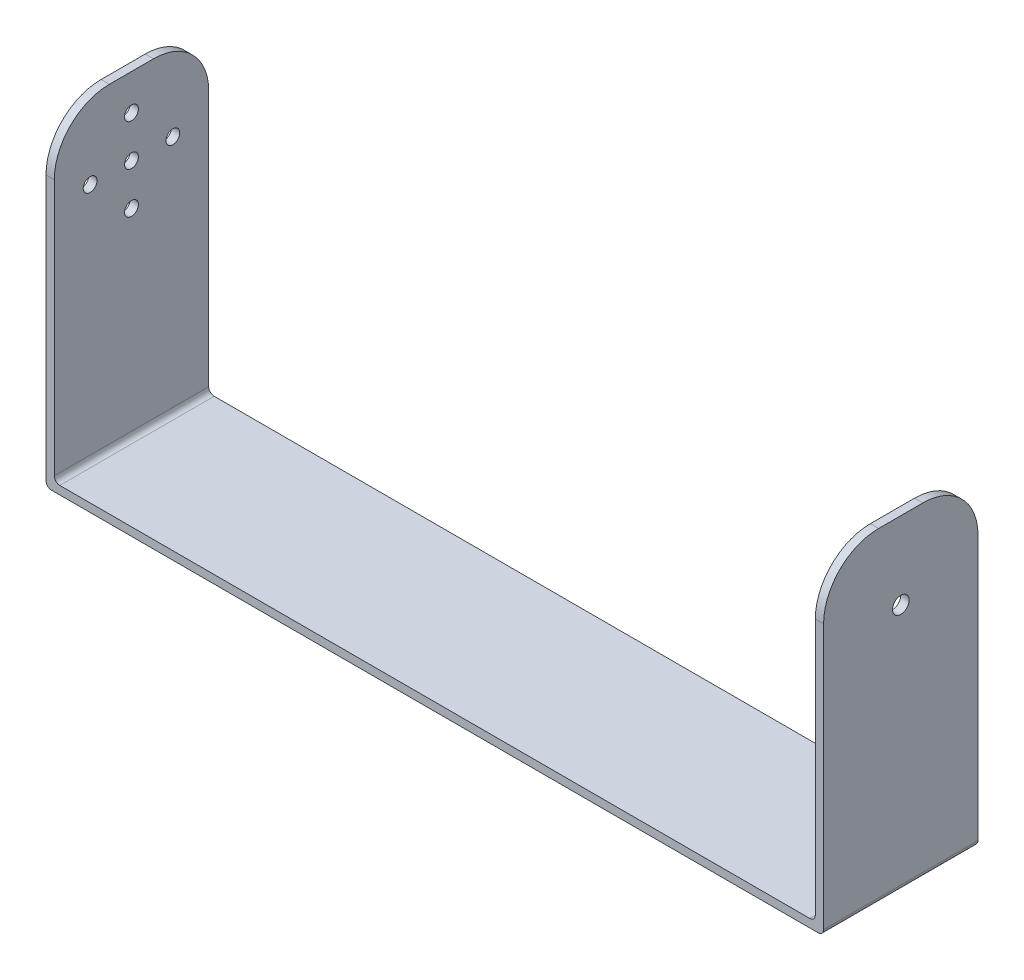
ISO-10303-21;
HEADER;
FILE_DESCRIPTION(('STEP AP214'),'2;1');
FILE_NAME('part.step','',(''),(''),'','','');
FILE_SCHEMA(('AUTOMOTIVE_DESIGN { 1 0 10303 214 1 1 1 1 }'));
ENDSEC;
DATA;
#1=APPLICATION_CONTEXT('core data for automotive mechanical design processes');
#2=APPLICATION_PROTOCOL_DEFINITION('international standard','automotive_design',2000,#1);
#3=PRODUCT_CONTEXT('',#1,'mechanical');
#4=PRODUCT('Part','Part','',(#3));
#5=PRODUCT_RELATED_PRODUCT_CATEGORY('part','',(#4));
#6=PRODUCT_DEFINITION_FORMATION('','',#4);
#7=PRODUCT_DEFINITION_CONTEXT('part definition',#1,'design');
#8=PRODUCT_DEFINITION('design','',#6,#7);
#9=PRODUCT_DEFINITION_SHAPE('','',#8);
#10=(LENGTH_UNIT() NAMED_UNIT(*) SI_UNIT(.MILLI.,.METRE.));
#11=(NAMED_UNIT(*) PLANE_ANGLE_UNIT() SI_UNIT($,.RADIAN.));
#12=(NAMED_UNIT(*) SI_UNIT($,.STERADIAN.) SOLID_ANGLE_UNIT());
#13=UNCERTAINTY_MEASURE_WITH_UNIT(LENGTH_MEASURE(1.E-05),#10,'distance_accuracy_value','');
#14=(GEOMETRIC_REPRESENTATION_CONTEXT(3) GLOBAL_UNCERTAINTY_ASSIGNED_CONTEXT((#13)) GLOBAL_UNIT_ASSIGNED_CONTEXT((#10,
#11,#12)) REPRESENTATION_CONTEXT('',''));
#15=CARTESIAN_POINT('',(0.,0.,0.));
#16=DIRECTION('',(0.,0.,1.));
#17=DIRECTION('',(1.,0.,0.));
#18=AXIS2_PLACEMENT_3D('',#15,#16,#17);
#19=CARTESIAN_POINT('',(139.5,0.,0.));
#20=DIRECTION('',(1.,0.,0.));
#21=DIRECTION('',(0.,0.,-1.));
#22=AXIS2_PLACEMENT_3D('',#19,#20,#21);
#23=PLANE('',#22);
#24=DIRECTION('',(0.,0.,1.));
#25=VECTOR('',#24,1.);
#26=CARTESIAN_POINT('',(139.5,59.,-28.));
#27=LINE('',#26,#25);
#28=CARTESIAN_POINT('',(139.5,59.,-18.));
#29=VERTEX_POINT('',#28);
#30=CARTESIAN_POINT('',(139.5,59.,-10.));
#31=VERTEX_POINT('',#30);
#32=EDGE_CURVE('E444',#29,#31,#27,.T.);
#33=ORIENTED_EDGE('',*,*,#32,.T.);
#34=CARTESIAN_POINT('',(139.5,49.,-10.));
#35=DIRECTION('',(1.,0.,0.));
#36=DIRECTION('',(0.,0.,-1.));
#37=AXIS2_PLACEMENT_3D('',#34,#35,#36);
#38=CIRCLE('',#37,10.);
#39=CARTESIAN_POINT('',(139.5,49.,0.));
#40=VERTEX_POINT('',#39);
#41=EDGE_CURVE('E11',#31,#40,#38,.T.);
#42=ORIENTED_EDGE('',*,*,#41,.T.);
#43=DIRECTION('',(0.,-1.,0.));
#44=VECTOR('',#43,1.);
#45=CARTESIAN_POINT('',(139.5,0.,0.));
#46=LINE('',#45,#44);
#47=CARTESIAN_POINT('',(139.5,1.,0.));
#48=VERTEX_POINT('',#47);
#49=EDGE_CURVE('E250',#40,#48,#46,.T.);
#50=ORIENTED_EDGE('',*,*,#49,.T.);
#51=DIRECTION('',(0.,0.,-1.));
#52=VECTOR('',#51,1.);
#53=CARTESIAN_POINT('',(139.5,1.,0.));
#54=LINE('',#53,#52);
#55=CARTESIAN_POINT('',(139.5,1.,-28.));
#56=VERTEX_POINT('',#55);
#57=EDGE_CURVE('E230',#48,#56,#54,.T.);
#58=ORIENTED_EDGE('',*,*,#57,.T.);
#59=DIRECTION('',(0.,1.,0.));
#60=VECTOR('',#59,1.);
#61=CARTESIAN_POINT('',(139.5,0.,-28.));
#62=LINE('',#61,#60);
#63=CARTESIAN_POINT('',(139.5,49.,-28.));
#64=VERTEX_POINT('',#63);
#65=EDGE_CURVE('E282',#56,#64,#62,.T.);
#66=ORIENTED_EDGE('',*,*,#65,.T.);
#67=CARTESIAN_POINT('',(139.5,49.,-18.));
#68=DIRECTION('',(1.,0.,0.));
#69=DIRECTION('',(0.,0.,-1.));
#70=AXIS2_PLACEMENT_3D('',#67,#68,#69);
#71=CIRCLE('',#70,10.);
#72=EDGE_CURVE('E283',#64,#29,#71,.T.);
#73=ORIENTED_EDGE('',*,*,#72,.T.);
#74=EDGE_LOOP('',(#33,#42,#50,#58,#66,#73));
#75=FACE_BOUND('',#74,.T.);
#76=CARTESIAN_POINT('',(139.5,45.,-14.));
#77=DIRECTION('',(1.,0.,0.));
#78=DIRECTION('',(0.,0.,-1.));
#79=AXIS2_PLACEMENT_3D('',#76,#77,#78);
#80=CIRCLE('',#79,1.5);
#81=CARTESIAN_POINT('',(139.5,45.,-15.5));
#82=VERTEX_POINT('',#81);
#83=EDGE_CURVE('E268',#82,#82,#80,.F.);
#84=ORIENTED_EDGE('',*,*,#83,.T.);
#85=EDGE_LOOP('',(#84));
#86=FACE_BOUND('',#85,.T.);
#87=ADVANCED_FACE('F33',(#75,#86),#23,.T.);
#88=CARTESIAN_POINT('',(138.,0.,0.));
#89=DIRECTION('',(1.,0.,0.));
#90=DIRECTION('',(0.,0.,-1.));
#91=AXIS2_PLACEMENT_3D('',#88,#89,#90);
#92=PLANE('',#91);
#93=DIRECTION('',(0.,-1.,0.));
#94=VECTOR('',#93,1.);
#95=CARTESIAN_POINT('',(138.,0.,0.));
#96=LINE('',#95,#94);
#97=CARTESIAN_POINT('',(138.,49.,0.));
#98=VERTEX_POINT('',#97);
#99=CARTESIAN_POINT('',(138.,2.5,0.));
#100=VERTEX_POINT('',#99);
#101=EDGE_CURVE('E275',#98,#100,#96,.T.);
#102=ORIENTED_EDGE('',*,*,#101,.F.);
#103=CARTESIAN_POINT('',(138.,49.,-10.));
#104=DIRECTION('',(1.,0.,0.));
#105=DIRECTION('',(0.,0.,-1.));
#106=AXIS2_PLACEMENT_3D('',#103,#104,#105);
#107=CIRCLE('',#106,10.);
#108=CARTESIAN_POINT('',(138.,59.,-10.));
#109=VERTEX_POINT('',#108);
#110=EDGE_CURVE('E55',#98,#109,#107,.F.);
#111=ORIENTED_EDGE('',*,*,#110,.T.);
#112=DIRECTION('',(0.,0.,1.));
#113=VECTOR('',#112,1.);
#114=CARTESIAN_POINT('',(138.,59.,-28.));
#115=LINE('',#114,#113);
#116=CARTESIAN_POINT('',(138.,59.,-18.));
#117=VERTEX_POINT('',#116);
#118=EDGE_CURVE('E267',#117,#109,#115,.T.);
#119=ORIENTED_EDGE('',*,*,#118,.F.);
#120=CARTESIAN_POINT('',(138.,49.,-18.));
#121=DIRECTION('',(1.,0.,0.));
#122=DIRECTION('',(0.,0.,-1.));
#123=AXIS2_PLACEMENT_3D('',#120,#121,#122);
#124=CIRCLE('',#123,10.);
#125=CARTESIAN_POINT('',(138.,49.,-28.));
#126=VERTEX_POINT('',#125);
#127=EDGE_CURVE('E293',#117,#126,#124,.F.);
#128=ORIENTED_EDGE('',*,*,#127,.T.);
#129=DIRECTION('',(0.,1.,0.));
#130=VECTOR('',#129,1.);
#131=CARTESIAN_POINT('',(138.,0.,-28.));
#132=LINE('',#131,#130);
#133=CARTESIAN_POINT('',(138.,2.5,-28.));
#134=VERTEX_POINT('',#133);
#135=EDGE_CURVE('E263',#134,#126,#132,.T.);
#136=ORIENTED_EDGE('',*,*,#135,.F.);
#137=DIRECTION('',(0.,0.,-1.));
#138=VECTOR('',#137,1.);
#139=CARTESIAN_POINT('',(138.,2.5,0.));
#140=LINE('',#139,#138);
#141=EDGE_CURVE('E262',#134,#100,#140,.F.);
#142=ORIENTED_EDGE('',*,*,#141,.T.);
#143=EDGE_LOOP('',(#102,#111,#119,#128,#136,#142));
#144=FACE_BOUND('',#143,.T.);
#145=CARTESIAN_POINT('',(138.,45.,-14.));
#146=DIRECTION('',(1.,0.,0.));
#147=DIRECTION('',(0.,0.,-1.));
#148=AXIS2_PLACEMENT_3D('',#145,#146,#147);
#149=CIRCLE('',#148,1.5);
#150=CARTESIAN_POINT('',(138.,45.,-15.5));
#151=VERTEX_POINT('',#150);
#152=EDGE_CURVE('E302',#151,#151,#149,.F.);
#153=ORIENTED_EDGE('',*,*,#152,.F.);
#154=EDGE_LOOP('',(#153));
#155=FACE_BOUND('',#154,.T.);
#156=ADVANCED_FACE('F309',(#144,#155),#92,.F.);
#157=CARTESIAN_POINT('',(-1.5,0.,0.));
#158=DIRECTION('',(-1.,0.,0.));
#159=DIRECTION('',(0.,0.,1.));
#160=AXIS2_PLACEMENT_3D('',#157,#158,#159);
#161=PLANE('',#160);
#162=CARTESIAN_POINT('',(-1.5,45.,-21.5));
#163=DIRECTION('',(-1.,0.,0.));
#164=DIRECTION('',(0.,0.,1.));
#165=AXIS2_PLACEMENT_3D('',#162,#163,#164);
#166=CIRCLE('',#165,1.25);
#167=CARTESIAN_POINT('',(-1.5,45.,-20.25));
#168=VERTEX_POINT('',#167);
#169=EDGE_CURVE('E242',#168,#168,#166,.F.);
#170=ORIENTED_EDGE('',*,*,#169,.T.);
#171=EDGE_LOOP('',(#170));
#172=FACE_BOUND('',#171,.T.);
#173=CARTESIAN_POINT('',(-1.5,45.,-6.50000000000001));
#174=DIRECTION('',(-1.,0.,0.));
#175=DIRECTION('',(0.,0.,1.));
#176=AXIS2_PLACEMENT_3D('',#173,#174,#175);
#177=CIRCLE('',#176,1.25);
#178=CARTESIAN_POINT('',(-1.5,45.,-5.25000000000001));
#179=VERTEX_POINT('',#178);
#180=EDGE_CURVE('E234',#179,#179,#177,.F.);
#181=ORIENTED_EDGE('',*,*,#180,.T.);
#182=EDGE_LOOP('',(#181));
#183=FACE_BOUND('',#182,.T.);
#184=DIRECTION('',(0.,-1.,0.));
#185=VECTOR('',#184,1.);
#186=CARTESIAN_POINT('',(-1.5,0.,0.));
#187=LINE('',#186,#185);
#188=CARTESIAN_POINT('',(-1.5,49.,0.));
#189=VERTEX_POINT('',#188);
#190=CARTESIAN_POINT('',(-1.5,1.,0.));
#191=VERTEX_POINT('',#190);
#192=EDGE_CURVE('E189',#189,#191,#187,.T.);
#193=ORIENTED_EDGE('',*,*,#192,.F.);
#194=CARTESIAN_POINT('',(-1.5,49.,-10.));
#195=DIRECTION('',(-1.,0.,0.));
#196=DIRECTION('',(0.,0.,1.));
#197=AXIS2_PLACEMENT_3D('',#194,#195,#196);
#198=CIRCLE('',#197,10.);
#199=CARTESIAN_POINT('',(-1.5,59.,-10.));
#200=VERTEX_POINT('',#199);
#201=EDGE_CURVE('E225',#189,#200,#198,.T.);
#202=ORIENTED_EDGE('',*,*,#201,.T.);
#203=DIRECTION('',(0.,0.,1.));
#204=VECTOR('',#203,1.);
#205=CARTESIAN_POINT('',(-1.5,59.,0.));
#206=LINE('',#205,#204);
#207=CARTESIAN_POINT('',(-1.5,59.,-18.));
#208=VERTEX_POINT('',#207);
#209=EDGE_CURVE('E185',#208,#200,#206,.T.);
#210=ORIENTED_EDGE('',*,*,#209,.F.);
#211=CARTESIAN_POINT('',(-1.5,49.,-18.));
#212=DIRECTION('',(-1.,0.,0.));
#213=DIRECTION('',(0.,0.,1.));
#214=AXIS2_PLACEMENT_3D('',#211,#212,#213);
#215=CIRCLE('',#214,10.);
#216=CARTESIAN_POINT('',(-1.5,49.,-28.));
#217=VERTEX_POINT('',#216);
#218=EDGE_CURVE('E223',#208,#217,#215,.T.);
#219=ORIENTED_EDGE('',*,*,#218,.T.);
#220=DIRECTION('',(0.,1.,0.));
#221=VECTOR('',#220,1.);
#222=CARTESIAN_POINT('',(-1.5,0.,-28.));
#223=LINE('',#222,#221);
#224=CARTESIAN_POINT('',(-1.5,1.,-28.));
#225=VERTEX_POINT('',#224);
#226=EDGE_CURVE('E336',#225,#217,#223,.T.);
#227=ORIENTED_EDGE('',*,*,#226,.F.);
#228=DIRECTION('',(0.,0.,-1.));
#229=VECTOR('',#228,1.);
#230=CARTESIAN_POINT('',(-1.5,1.,0.));
#231=LINE('',#230,#229);
#232=EDGE_CURVE('E205',#225,#191,#231,.F.);
#233=ORIENTED_EDGE('',*,*,#232,.T.);
#234=EDGE_LOOP('',(#193,#202,#210,#219,#227,#233));
#235=FACE_BOUND('',#234,.T.);
#236=CARTESIAN_POINT('',(-1.5,52.5,-14.));
#237=DIRECTION('',(-1.,0.,0.));
#238=DIRECTION('',(0.,0.,1.));
#239=AXIS2_PLACEMENT_3D('',#236,#237,#238);
#240=CIRCLE('',#239,1.25);
#241=CARTESIAN_POINT('',(-1.5,52.5,-12.75));
#242=VERTEX_POINT('',#241);
#243=EDGE_CURVE('E217',#242,#242,#240,.F.);
#244=ORIENTED_EDGE('',*,*,#243,.T.);
#245=EDGE_LOOP('',(#244));
#246=FACE_BOUND('',#245,.T.);
#247=CARTESIAN_POINT('',(-1.5,45.,-14.));
#248=DIRECTION('',(-1.,0.,0.));
#249=DIRECTION('',(0.,0.,1.));
#250=AXIS2_PLACEMENT_3D('',#247,#248,#249);
#251=CIRCLE('',#250,1.25);
#252=CARTESIAN_POINT('',(-1.5,45.,-12.75));
#253=VERTEX_POINT('',#252);
#254=EDGE_CURVE('E238',#253,#253,#251,.F.);
#255=ORIENTED_EDGE('',*,*,#254,.T.);
#256=EDGE_LOOP('',(#255));
#257=FACE_BOUND('',#256,.T.);
#258=CARTESIAN_POINT('',(-1.5,37.5,-14.));
#259=DIRECTION('',(-1.,0.,0.));
#260=DIRECTION('',(0.,0.,1.));
#261=AXIS2_PLACEMENT_3D('',#258,#259,#260);
#262=CIRCLE('',#261,1.25);
#263=CARTESIAN_POINT('',(-1.5,37.5,-12.75));
#264=VERTEX_POINT('',#263);
#265=EDGE_CURVE('E246',#264,#264,#262,.F.);
#266=ORIENTED_EDGE('',*,*,#265,.T.);
#267=EDGE_LOOP('',(#266));
#268=FACE_BOUND('',#267,.T.);
#269=ADVANCED_FACE('F330',(#172,#183,#235,#246,#257,#268),#161,.T.);
#270=CARTESIAN_POINT('',(0.,0.,0.));
#271=DIRECTION('',(-1.,0.,0.));
#272=DIRECTION('',(0.,0.,1.));
#273=AXIS2_PLACEMENT_3D('',#270,#271,#272);
#274=PLANE('',#273);
#275=CARTESIAN_POINT('',(0.,45.,-21.5));
#276=DIRECTION('',(-1.,0.,0.));
#277=DIRECTION('',(0.,0.,1.));
#278=AXIS2_PLACEMENT_3D('',#275,#276,#277);
#279=CIRCLE('',#278,1.25);
#280=CARTESIAN_POINT('',(0.,45.,-20.25));
#281=VERTEX_POINT('',#280);
#282=EDGE_CURVE('E243',#281,#281,#279,.F.);
#283=ORIENTED_EDGE('',*,*,#282,.F.);
#284=EDGE_LOOP('',(#283));
#285=FACE_BOUND('',#284,.T.);
#286=CARTESIAN_POINT('',(0.,45.,-6.50000000000001));
#287=DIRECTION('',(-1.,0.,0.));
#288=DIRECTION('',(0.,0.,1.));
#289=AXIS2_PLACEMENT_3D('',#286,#287,#288);
#290=CIRCLE('',#289,1.25);
#291=CARTESIAN_POINT('',(0.,45.,-5.25000000000001));
#292=VERTEX_POINT('',#291);
#293=EDGE_CURVE('E235',#292,#292,#290,.F.);
#294=ORIENTED_EDGE('',*,*,#293,.F.);
#295=EDGE_LOOP('',(#294));
#296=FACE_BOUND('',#295,.T.);
#297=DIRECTION('',(0.,0.,1.));
#298=VECTOR('',#297,1.);
#299=CARTESIAN_POINT('',(0.,59.,0.));
#300=LINE('',#299,#298);
#301=CARTESIAN_POINT('',(0.,59.,-18.));
#302=VERTEX_POINT('',#301);
#303=CARTESIAN_POINT('',(0.,59.,-10.));
#304=VERTEX_POINT('',#303);
#305=EDGE_CURVE('E186',#302,#304,#300,.T.);
#306=ORIENTED_EDGE('',*,*,#305,.T.);
#307=CARTESIAN_POINT('',(0.,49.,-10.));
#308=DIRECTION('',(-1.,0.,0.));
#309=DIRECTION('',(0.,0.,1.));
#310=AXIS2_PLACEMENT_3D('',#307,#308,#309);
#311=CIRCLE('',#310,10.);
#312=CARTESIAN_POINT('',(0.,49.,0.));
#313=VERTEX_POINT('',#312);
#314=EDGE_CURVE('E219',#304,#313,#311,.F.);
#315=ORIENTED_EDGE('',*,*,#314,.T.);
#316=DIRECTION('',(0.,-1.,0.));
#317=VECTOR('',#316,1.);
#318=CARTESIAN_POINT('',(0.,0.,0.));
#319=LINE('',#318,#317);
#320=CARTESIAN_POINT('',(0.,2.5,0.));
#321=VERTEX_POINT('',#320);
#322=EDGE_CURVE('E197',#313,#321,#319,.T.);
#323=ORIENTED_EDGE('',*,*,#322,.T.);
#324=DIRECTION('',(0.,0.,1.));
#325=VECTOR('',#324,1.);
#326=CARTESIAN_POINT('',(0.,2.5,-28.));
#327=LINE('',#326,#325);
#328=CARTESIAN_POINT('',(0.,2.5,-28.));
#329=VERTEX_POINT('',#328);
#330=EDGE_CURVE('E152',#321,#329,#327,.F.);
#331=ORIENTED_EDGE('',*,*,#330,.T.);
#332=DIRECTION('',(0.,1.,0.));
#333=VECTOR('',#332,1.);
#334=CARTESIAN_POINT('',(0.,0.,-28.));
#335=LINE('',#334,#333);
#336=CARTESIAN_POINT('',(0.,49.,-28.));
#337=VERTEX_POINT('',#336);
#338=EDGE_CURVE('E190',#329,#337,#335,.T.);
#339=ORIENTED_EDGE('',*,*,#338,.T.);
#340=CARTESIAN_POINT('',(0.,49.,-18.));
#341=DIRECTION('',(-1.,0.,0.));
#342=DIRECTION('',(0.,0.,1.));
#343=AXIS2_PLACEMENT_3D('',#340,#341,#342);
#344=CIRCLE('',#343,10.);
#345=EDGE_CURVE('E215',#337,#302,#344,.F.);
#346=ORIENTED_EDGE('',*,*,#345,.T.);
#347=EDGE_LOOP('',(#306,#315,#323,#331,#339,#346));
#348=FACE_BOUND('',#347,.T.);
#349=CARTESIAN_POINT('',(0.,52.5,-14.));
#350=DIRECTION('',(-1.,0.,0.));
#351=DIRECTION('',(0.,0.,1.));
#352=AXIS2_PLACEMENT_3D('',#349,#350,#351);
#353=CIRCLE('',#352,1.25);
#354=CARTESIAN_POINT('',(0.,52.5,-12.75));
#355=VERTEX_POINT('',#354);
#356=EDGE_CURVE('E231',#355,#355,#353,.F.);
#357=ORIENTED_EDGE('',*,*,#356,.F.);
#358=EDGE_LOOP('',(#357));
#359=FACE_BOUND('',#358,.T.);
#360=CARTESIAN_POINT('',(0.,45.,-14.));
#361=DIRECTION('',(-1.,0.,0.));
#362=DIRECTION('',(0.,0.,1.));
#363=AXIS2_PLACEMENT_3D('',#360,#361,#362);
#364=CIRCLE('',#363,1.25);
#365=CARTESIAN_POINT('',(0.,45.,-12.75));
#366=VERTEX_POINT('',#365);
#367=EDGE_CURVE('E239',#366,#366,#364,.F.);
#368=ORIENTED_EDGE('',*,*,#367,.F.);
#369=EDGE_LOOP('',(#368));
#370=FACE_BOUND('',#369,.T.);
#371=CARTESIAN_POINT('',(0.,37.5,-14.));
#372=DIRECTION('',(-1.,0.,0.));
#373=DIRECTION('',(0.,0.,1.));
#374=AXIS2_PLACEMENT_3D('',#371,#372,#373);
#375=CIRCLE('',#374,1.25);
#376=CARTESIAN_POINT('',(0.,37.5,-12.75));
#377=VERTEX_POINT('',#376);
#378=EDGE_CURVE('E247',#377,#377,#375,.F.);
#379=ORIENTED_EDGE('',*,*,#378,.F.);
#380=EDGE_LOOP('',(#379));
#381=FACE_BOUND('',#380,.T.);
#382=ADVANCED_FACE('F318',(#285,#296,#348,#359,#370,#381),#274,.F.);
#383=CARTESIAN_POINT('',(0.,1.5,0.));
#384=DIRECTION('',(0.,0.,-1.));
#385=DIRECTION('',(-1.,0.,0.));
#386=AXIS2_PLACEMENT_3D('',#383,#384,#385);
#387=PLANE('',#386);
#388=ORIENTED_EDGE('',*,*,#49,.F.);
#389=DIRECTION('',(-1.,0.,0.));
#390=VECTOR('',#389,1.);
#391=CARTESIAN_POINT('',(0.,49.,0.));
#392=LINE('',#391,#390);
#393=EDGE_CURVE('E285',#40,#98,#392,.T.);
#394=ORIENTED_EDGE('',*,*,#393,.T.);
#395=ORIENTED_EDGE('',*,*,#101,.T.);
#396=CARTESIAN_POINT('',(137.,2.5,0.));
#397=DIRECTION('',(0.,0.,-1.));
#398=DIRECTION('',(-1.,0.,0.));
#399=AXIS2_PLACEMENT_3D('',#396,#397,#398);
#400=CIRCLE('',#399,1.);
#401=CARTESIAN_POINT('',(137.,1.5,0.));
#402=VERTEX_POINT('',#401);
#403=EDGE_CURVE('E171',#100,#402,#400,.T.);
#404=ORIENTED_EDGE('',*,*,#403,.T.);
#405=DIRECTION('',(1.,0.,0.));
#406=VECTOR('',#405,1.);
#407=CARTESIAN_POINT('',(0.,1.5,0.));
#408=LINE('',#407,#406);
#409=CARTESIAN_POINT('',(1.,1.5,0.));
#410=VERTEX_POINT('',#409);
#411=EDGE_CURVE('E162',#410,#402,#408,.T.);
#412=ORIENTED_EDGE('',*,*,#411,.F.);
#413=CARTESIAN_POINT('',(1.,2.5,0.));
#414=DIRECTION('',(0.,0.,-1.));
#415=DIRECTION('',(-1.,0.,0.));
#416=AXIS2_PLACEMENT_3D('',#413,#414,#415);
#417=CIRCLE('',#416,1.);
#418=EDGE_CURVE('E147',#410,#321,#417,.T.);
#419=ORIENTED_EDGE('',*,*,#418,.T.);
#420=ORIENTED_EDGE('',*,*,#322,.F.);
#421=DIRECTION('',(1.,0.,0.));
#422=VECTOR('',#421,1.);
#423=CARTESIAN_POINT('',(-1.5,49.,0.));
#424=LINE('',#423,#422);
#425=EDGE_CURVE('E221',#313,#189,#424,.F.);
#426=ORIENTED_EDGE('',*,*,#425,.T.);
#427=ORIENTED_EDGE('',*,*,#192,.T.);
#428=CARTESIAN_POINT('',(-0.5,1.,0.));
#429=DIRECTION('',(0.,0.,-1.));
#430=DIRECTION('',(-1.,0.,0.));
#431=AXIS2_PLACEMENT_3D('',#428,#429,#430);
#432=CIRCLE('',#431,1.);
#433=CARTESIAN_POINT('',(-0.5,0.,0.));
#434=VERTEX_POINT('',#433);
#435=EDGE_CURVE('E208',#191,#434,#432,.F.);
#436=ORIENTED_EDGE('',*,*,#435,.T.);
#437=DIRECTION('',(1.,0.,0.));
#438=VECTOR('',#437,1.);
#439=CARTESIAN_POINT('',(0.,0.,0.));
#440=LINE('',#439,#438);
#441=CARTESIAN_POINT('',(138.5,0.,0.));
#442=VERTEX_POINT('',#441);
#443=EDGE_CURVE('E175',#434,#442,#440,.T.);
#444=ORIENTED_EDGE('',*,*,#443,.T.);
#445=CARTESIAN_POINT('',(138.5,1.,0.));
#446=DIRECTION('',(0.,0.,-1.));
#447=DIRECTION('',(-1.,0.,0.));
#448=AXIS2_PLACEMENT_3D('',#445,#446,#447);
#449=CIRCLE('',#448,1.);
#450=EDGE_CURVE('E257',#442,#48,#449,.F.);
#451=ORIENTED_EDGE('',*,*,#450,.T.);
#452=EDGE_LOOP('',(#388,#394,#395,#404,#412,#419,#420,#426,#427,#436,#444,#451));
#453=FACE_BOUND('',#452,.T.);
#454=ADVANCED_FACE('F169',(#453),#387,.F.);
#455=CARTESIAN_POINT('',(0.,1.5,-28.));
#456=DIRECTION('',(0.,0.,1.));
#457=DIRECTION('',(1.,0.,0.));
#458=AXIS2_PLACEMENT_3D('',#455,#456,#457);
#459=PLANE('',#458);
#460=ORIENTED_EDGE('',*,*,#135,.T.);
#461=DIRECTION('',(-1.,0.,0.));
#462=VECTOR('',#461,1.);
#463=CARTESIAN_POINT('',(0.,49.,-28.));
#464=LINE('',#463,#462);
#465=EDGE_CURVE('E289',#126,#64,#464,.F.);
#466=ORIENTED_EDGE('',*,*,#465,.T.);
#467=ORIENTED_EDGE('',*,*,#65,.F.);
#468=CARTESIAN_POINT('',(138.5,1.,-28.));
#469=DIRECTION('',(0.,0.,1.));
#470=DIRECTION('',(1.,0.,0.));
#471=AXIS2_PLACEMENT_3D('',#468,#469,#470);
#472=CIRCLE('',#471,1.);
#473=CARTESIAN_POINT('',(138.5,0.,-28.));
#474=VERTEX_POINT('',#473);
#475=EDGE_CURVE('E253',#56,#474,#472,.F.);
#476=ORIENTED_EDGE('',*,*,#475,.T.);
#477=DIRECTION('',(-1.,0.,0.));
#478=VECTOR('',#477,1.);
#479=CARTESIAN_POINT('',(0.,0.,-28.));
#480=LINE('',#479,#478);
#481=CARTESIAN_POINT('',(-0.5,0.,-28.));
#482=VERTEX_POINT('',#481);
#483=EDGE_CURVE('E172',#474,#482,#480,.T.);
#484=ORIENTED_EDGE('',*,*,#483,.T.);
#485=CARTESIAN_POINT('',(-0.5,1.,-28.));
#486=DIRECTION('',(0.,0.,1.));
#487=DIRECTION('',(1.,0.,0.));
#488=AXIS2_PLACEMENT_3D('',#485,#486,#487);
#489=CIRCLE('',#488,1.);
#490=EDGE_CURVE('E203',#482,#225,#489,.F.);
#491=ORIENTED_EDGE('',*,*,#490,.T.);
#492=ORIENTED_EDGE('',*,*,#226,.T.);
#493=DIRECTION('',(1.,0.,0.));
#494=VECTOR('',#493,1.);
#495=CARTESIAN_POINT('',(0.,49.,-28.));
#496=LINE('',#495,#494);
#497=EDGE_CURVE('E227',#217,#337,#496,.T.);
#498=ORIENTED_EDGE('',*,*,#497,.T.);
#499=ORIENTED_EDGE('',*,*,#338,.F.);
#500=CARTESIAN_POINT('',(1.,2.5,-28.));
#501=DIRECTION('',(0.,0.,1.));
#502=DIRECTION('',(1.,0.,0.));
#503=AXIS2_PLACEMENT_3D('',#500,#501,#502);
#504=CIRCLE('',#503,1.);
#505=CARTESIAN_POINT('',(1.,1.5,-28.));
#506=VERTEX_POINT('',#505);
#507=EDGE_CURVE('E156',#329,#506,#504,.T.);
#508=ORIENTED_EDGE('',*,*,#507,.T.);
#509=DIRECTION('',(-1.,0.,0.));
#510=VECTOR('',#509,1.);
#511=CARTESIAN_POINT('',(0.,1.5,-28.));
#512=LINE('',#511,#510);
#513=CARTESIAN_POINT('',(137.,1.5,-28.));
#514=VERTEX_POINT('',#513);
#515=EDGE_CURVE('E165',#514,#506,#512,.T.);
#516=ORIENTED_EDGE('',*,*,#515,.F.);
#517=CARTESIAN_POINT('',(137.,2.5,-28.));
#518=DIRECTION('',(0.,0.,1.));
#519=DIRECTION('',(1.,0.,0.));
#520=AXIS2_PLACEMENT_3D('',#517,#518,#519);
#521=CIRCLE('',#520,1.);
#522=EDGE_CURVE('E305',#514,#134,#521,.T.);
#523=ORIENTED_EDGE('',*,*,#522,.T.);
#524=EDGE_LOOP('',(#460,#466,#467,#476,#484,#491,#492,#498,#499,#508,#516,#523));
#525=FACE_BOUND('',#524,.T.);
#526=ADVANCED_FACE('F313',(#525),#459,.F.);
#527=CARTESIAN_POINT('',(0.,1.5,0.));
#528=DIRECTION('',(0.,-1.,0.));
#529=DIRECTION('',(0.,0.,-1.));
#530=AXIS2_PLACEMENT_3D('',#527,#528,#529);
#531=PLANE('',#530);
#532=ORIENTED_EDGE('',*,*,#411,.T.);
#533=DIRECTION('',(0.,0.,-1.));
#534=VECTOR('',#533,1.);
#535=CARTESIAN_POINT('',(137.,1.5,-28.));
#536=LINE('',#535,#534);
#537=EDGE_CURVE('E259',#402,#514,#536,.T.);
#538=ORIENTED_EDGE('',*,*,#537,.T.);
#539=ORIENTED_EDGE('',*,*,#515,.T.);
#540=DIRECTION('',(0.,0.,1.));
#541=VECTOR('',#540,1.);
#542=CARTESIAN_POINT('',(1.,1.5,0.));
#543=LINE('',#542,#541);
#544=EDGE_CURVE('E151',#506,#410,#543,.T.);
#545=ORIENTED_EDGE('',*,*,#544,.T.);
#546=EDGE_LOOP('',(#532,#538,#539,#545));
#547=FACE_BOUND('',#546,.T.);
#548=ADVANCED_FACE('F160',(#547),#531,.F.);
#549=CARTESIAN_POINT('',(0.,0.,0.));
#550=DIRECTION('',(0.,-1.,0.));
#551=DIRECTION('',(0.,0.,-1.));
#552=AXIS2_PLACEMENT_3D('',#549,#550,#551);
#553=PLANE('',#552);
#554=ORIENTED_EDGE('',*,*,#483,.F.);
#555=DIRECTION('',(0.,0.,-1.));
#556=VECTOR('',#555,1.);
#557=CARTESIAN_POINT('',(138.5,0.,0.));
#558=LINE('',#557,#556);
#559=EDGE_CURVE('E255',#474,#442,#558,.F.);
#560=ORIENTED_EDGE('',*,*,#559,.T.);
#561=ORIENTED_EDGE('',*,*,#443,.F.);
#562=DIRECTION('',(0.,0.,-1.));
#563=VECTOR('',#562,1.);
#564=CARTESIAN_POINT('',(-0.5,0.,0.));
#565=LINE('',#564,#563);
#566=EDGE_CURVE('E200',#434,#482,#565,.T.);
#567=ORIENTED_EDGE('',*,*,#566,.T.);
#568=EDGE_LOOP('',(#554,#560,#561,#567));
#569=FACE_BOUND('',#568,.T.);
#570=ADVANCED_FACE('F409',(#569),#553,.T.);
#571=CARTESIAN_POINT('',(-1.5,59.,0.));
#572=DIRECTION('',(0.,1.,0.));
#573=DIRECTION('',(0.,0.,1.));
#574=AXIS2_PLACEMENT_3D('',#571,#572,#573);
#575=PLANE('',#574);
#576=ORIENTED_EDGE('',*,*,#209,.T.);
#577=DIRECTION('',(1.,0.,0.));
#578=VECTOR('',#577,1.);
#579=CARTESIAN_POINT('',(0.,59.,-10.));
#580=LINE('',#579,#578);
#581=EDGE_CURVE('E212',#200,#304,#580,.T.);
#582=ORIENTED_EDGE('',*,*,#581,.T.);
#583=ORIENTED_EDGE('',*,*,#305,.F.);
#584=DIRECTION('',(1.,0.,0.));
#585=VECTOR('',#584,1.);
#586=CARTESIAN_POINT('',(-1.5,59.,-18.));
#587=LINE('',#586,#585);
#588=EDGE_CURVE('E210',#302,#208,#587,.F.);
#589=ORIENTED_EDGE('',*,*,#588,.T.);
#590=EDGE_LOOP('',(#576,#582,#583,#589));
#591=FACE_BOUND('',#590,.T.);
#592=ADVANCED_FACE('F334',(#591),#575,.T.);
#593=CARTESIAN_POINT('',(1.,2.5,0.));
#594=DIRECTION('',(0.,0.,-1.));
#595=DIRECTION('',(-1.,0.,0.));
#596=AXIS2_PLACEMENT_3D('',#593,#594,#595);
#597=CYLINDRICAL_SURFACE('',#596,1.);
#598=ORIENTED_EDGE('',*,*,#507,.F.);
#599=ORIENTED_EDGE('',*,*,#330,.F.);
#600=ORIENTED_EDGE('',*,*,#418,.F.);
#601=ORIENTED_EDGE('',*,*,#544,.F.);
#602=EDGE_LOOP('',(#598,#599,#600,#601));
#603=FACE_BOUND('',#602,.T.);
#604=ADVANCED_FACE('F150',(#603),#597,.F.);
#605=CARTESIAN_POINT('',(-0.5,1.,0.));
#606=DIRECTION('',(0.,0.,-1.));
#607=DIRECTION('',(-1.,0.,0.));
#608=AXIS2_PLACEMENT_3D('',#605,#606,#607);
#609=CYLINDRICAL_SURFACE('',#608,1.);
#610=ORIENTED_EDGE('',*,*,#435,.F.);
#611=ORIENTED_EDGE('',*,*,#232,.F.);
#612=ORIENTED_EDGE('',*,*,#490,.F.);
#613=ORIENTED_EDGE('',*,*,#566,.F.);
#614=EDGE_LOOP('',(#610,#611,#612,#613));
#615=FACE_BOUND('',#614,.T.);
#616=ADVANCED_FACE('F421',(#615),#609,.T.);
#617=CARTESIAN_POINT('',(-1.5,49.,-10.));
#618=DIRECTION('',(-1.,0.,0.));
#619=DIRECTION('',(0.,0.,1.));
#620=AXIS2_PLACEMENT_3D('',#617,#618,#619);
#621=CYLINDRICAL_SURFACE('',#620,10.);
#622=ORIENTED_EDGE('',*,*,#201,.F.);
#623=ORIENTED_EDGE('',*,*,#425,.F.);
#624=ORIENTED_EDGE('',*,*,#314,.F.);
#625=ORIENTED_EDGE('',*,*,#581,.F.);
#626=EDGE_LOOP('',(#622,#623,#624,#625));
#627=FACE_BOUND('',#626,.T.);
#628=ADVANCED_FACE('F325',(#627),#621,.T.);
#629=CARTESIAN_POINT('',(0.,49.,-18.));
#630=DIRECTION('',(-1.,0.,0.));
#631=DIRECTION('',(0.,0.,1.));
#632=AXIS2_PLACEMENT_3D('',#629,#630,#631);
#633=CYLINDRICAL_SURFACE('',#632,10.);
#634=ORIENTED_EDGE('',*,*,#218,.F.);
#635=ORIENTED_EDGE('',*,*,#588,.F.);
#636=ORIENTED_EDGE('',*,*,#345,.F.);
#637=ORIENTED_EDGE('',*,*,#497,.F.);
#638=EDGE_LOOP('',(#634,#635,#636,#637));
#639=FACE_BOUND('',#638,.T.);
#640=ADVANCED_FACE('F374',(#639),#633,.T.);
#641=CARTESIAN_POINT('',(15.,52.5,-14.));
#642=DIRECTION('',(-1.,0.,0.));
#643=DIRECTION('',(0.,0.,1.));
#644=AXIS2_PLACEMENT_3D('',#641,#642,#643);
#645=CYLINDRICAL_SURFACE('',#644,1.25);
#646=ORIENTED_EDGE('',*,*,#243,.F.);
#647=EDGE_LOOP('',(#646));
#648=FACE_BOUND('',#647,.T.);
#649=ORIENTED_EDGE('',*,*,#356,.T.);
#650=EDGE_LOOP('',(#649));
#651=FACE_BOUND('',#650,.T.);
#652=ADVANCED_FACE('F365',(#648,#651),#645,.F.);
#653=CARTESIAN_POINT('',(15.,45.,-6.50000000000001));
#654=DIRECTION('',(-1.,0.,0.));
#655=DIRECTION('',(0.,0.,1.));
#656=AXIS2_PLACEMENT_3D('',#653,#654,#655);
#657=CYLINDRICAL_SURFACE('',#656,1.25);
#658=ORIENTED_EDGE('',*,*,#180,.F.);
#659=EDGE_LOOP('',(#658));
#660=FACE_BOUND('',#659,.T.);
#661=ORIENTED_EDGE('',*,*,#293,.T.);
#662=EDGE_LOOP('',(#661));
#663=FACE_BOUND('',#662,.T.);
#664=ADVANCED_FACE('F363',(#660,#663),#657,.F.);
#665=CARTESIAN_POINT('',(15.,45.,-14.));
#666=DIRECTION('',(-1.,0.,0.));
#667=DIRECTION('',(0.,0.,1.));
#668=AXIS2_PLACEMENT_3D('',#665,#666,#667);
#669=CYLINDRICAL_SURFACE('',#668,1.25);
#670=ORIENTED_EDGE('',*,*,#254,.F.);
#671=EDGE_LOOP('',(#670));
#672=FACE_BOUND('',#671,.T.);
#673=ORIENTED_EDGE('',*,*,#367,.T.);
#674=EDGE_LOOP('',(#673));
#675=FACE_BOUND('',#674,.T.);
#676=ADVANCED_FACE('F354',(#672,#675),#669,.F.);
#677=CARTESIAN_POINT('',(15.,45.,-21.5));
#678=DIRECTION('',(-1.,0.,0.));
#679=DIRECTION('',(0.,0.,1.));
#680=AXIS2_PLACEMENT_3D('',#677,#678,#679);
#681=CYLINDRICAL_SURFACE('',#680,1.25);
#682=ORIENTED_EDGE('',*,*,#169,.F.);
#683=EDGE_LOOP('',(#682));
#684=FACE_BOUND('',#683,.T.);
#685=ORIENTED_EDGE('',*,*,#282,.T.);
#686=EDGE_LOOP('',(#685));
#687=FACE_BOUND('',#686,.T.);
#688=ADVANCED_FACE('F350',(#684,#687),#681,.F.);
#689=CARTESIAN_POINT('',(15.,37.5,-14.));
#690=DIRECTION('',(-1.,0.,0.));
#691=DIRECTION('',(0.,0.,1.));
#692=AXIS2_PLACEMENT_3D('',#689,#690,#691);
#693=CYLINDRICAL_SURFACE('',#692,1.25);
#694=ORIENTED_EDGE('',*,*,#265,.F.);
#695=EDGE_LOOP('',(#694));
#696=FACE_BOUND('',#695,.T.);
#697=ORIENTED_EDGE('',*,*,#378,.T.);
#698=EDGE_LOOP('',(#697));
#699=FACE_BOUND('',#698,.T.);
#700=ADVANCED_FACE('F353',(#696,#699),#693,.F.);
#701=CARTESIAN_POINT('',(139.5,59.,-28.));
#702=DIRECTION('',(0.,-1.,0.));
#703=DIRECTION('',(0.,0.,-1.));
#704=AXIS2_PLACEMENT_3D('',#701,#702,#703);
#705=PLANE('',#704);
#706=ORIENTED_EDGE('',*,*,#118,.T.);
#707=DIRECTION('',(-1.,0.,0.));
#708=VECTOR('',#707,1.);
#709=CARTESIAN_POINT('',(139.5,59.,-10.));
#710=LINE('',#709,#708);
#711=EDGE_CURVE('E41',#109,#31,#710,.F.);
#712=ORIENTED_EDGE('',*,*,#711,.T.);
#713=ORIENTED_EDGE('',*,*,#32,.F.);
#714=DIRECTION('',(-1.,0.,0.));
#715=VECTOR('',#714,1.);
#716=CARTESIAN_POINT('',(139.5,59.,-18.));
#717=LINE('',#716,#715);
#718=EDGE_CURVE('E297',#29,#117,#717,.T.);
#719=ORIENTED_EDGE('',*,*,#718,.T.);
#720=EDGE_LOOP('',(#706,#712,#713,#719));
#721=FACE_BOUND('',#720,.T.);
#722=ADVANCED_FACE('F388',(#721),#705,.F.);
#723=CARTESIAN_POINT('',(138.5,1.,0.));
#724=DIRECTION('',(0.,0.,-1.));
#725=DIRECTION('',(-1.,0.,0.));
#726=AXIS2_PLACEMENT_3D('',#723,#724,#725);
#727=CYLINDRICAL_SURFACE('',#726,1.);
#728=ORIENTED_EDGE('',*,*,#450,.F.);
#729=ORIENTED_EDGE('',*,*,#559,.F.);
#730=ORIENTED_EDGE('',*,*,#475,.F.);
#731=ORIENTED_EDGE('',*,*,#57,.F.);
#732=EDGE_LOOP('',(#728,#729,#730,#731));
#733=FACE_BOUND('',#732,.T.);
#734=ADVANCED_FACE('F391',(#733),#727,.T.);
#735=CARTESIAN_POINT('',(137.,2.5,0.));
#736=DIRECTION('',(0.,0.,1.));
#737=DIRECTION('',(1.,0.,0.));
#738=AXIS2_PLACEMENT_3D('',#735,#736,#737);
#739=CYLINDRICAL_SURFACE('',#738,1.);
#740=ORIENTED_EDGE('',*,*,#403,.F.);
#741=ORIENTED_EDGE('',*,*,#141,.F.);
#742=ORIENTED_EDGE('',*,*,#522,.F.);
#743=ORIENTED_EDGE('',*,*,#537,.F.);
#744=EDGE_LOOP('',(#740,#741,#742,#743));
#745=FACE_BOUND('',#744,.T.);
#746=ADVANCED_FACE('F312',(#745),#739,.F.);
#747=CARTESIAN_POINT('',(141.,45.,-14.));
#748=DIRECTION('',(-1.,0.,0.));
#749=DIRECTION('',(0.,0.,1.));
#750=AXIS2_PLACEMENT_3D('',#747,#748,#749);
#751=CYLINDRICAL_SURFACE('',#750,1.5);
#752=ORIENTED_EDGE('',*,*,#83,.F.);
#753=EDGE_LOOP('',(#752));
#754=FACE_BOUND('',#753,.T.);
#755=ORIENTED_EDGE('',*,*,#152,.T.);
#756=EDGE_LOOP('',(#755));
#757=FACE_BOUND('',#756,.T.);
#758=ADVANCED_FACE('F386',(#754,#757),#751,.F.);
#759=CARTESIAN_POINT('',(139.5,49.,-18.));
#760=DIRECTION('',(-1.,0.,0.));
#761=DIRECTION('',(0.,0.,1.));
#762=AXIS2_PLACEMENT_3D('',#759,#760,#761);
#763=CYLINDRICAL_SURFACE('',#762,10.);
#764=ORIENTED_EDGE('',*,*,#72,.F.);
#765=ORIENTED_EDGE('',*,*,#465,.F.);
#766=ORIENTED_EDGE('',*,*,#127,.F.);
#767=ORIENTED_EDGE('',*,*,#718,.F.);
#768=EDGE_LOOP('',(#764,#765,#766,#767));
#769=FACE_BOUND('',#768,.T.);
#770=ADVANCED_FACE('F434',(#769),#763,.T.);
#771=CARTESIAN_POINT('',(0.,49.,-10.));
#772=DIRECTION('',(-1.,0.,0.));
#773=DIRECTION('',(0.,0.,1.));
#774=AXIS2_PLACEMENT_3D('',#771,#772,#773);
#775=CYLINDRICAL_SURFACE('',#774,10.);
#776=ORIENTED_EDGE('',*,*,#41,.F.);
#777=ORIENTED_EDGE('',*,*,#711,.F.);
#778=ORIENTED_EDGE('',*,*,#110,.F.);
#779=ORIENTED_EDGE('',*,*,#393,.F.);
#780=EDGE_LOOP('',(#776,#777,#778,#779));
#781=FACE_BOUND('',#780,.T.);
#782=ADVANCED_FACE('F35',(#781),#775,.T.);
#783=CLOSED_SHELL('',(#87,#156,#269,#382,#454,#526,#548,#570,#592,#604,#616,#628,#640,#652,#664,
#676,#688,#700,#722,#734,#746,#758,#770,#782));
#784=MANIFOLD_SOLID_BREP('B2',#783);
#785=ADVANCED_BREP_SHAPE_REPRESENTATION('',(#18,#784),#14);
#786=SHAPE_DEFINITION_REPRESENTATION(#9,#785);
ENDSEC;
END-ISO-10303-21;
